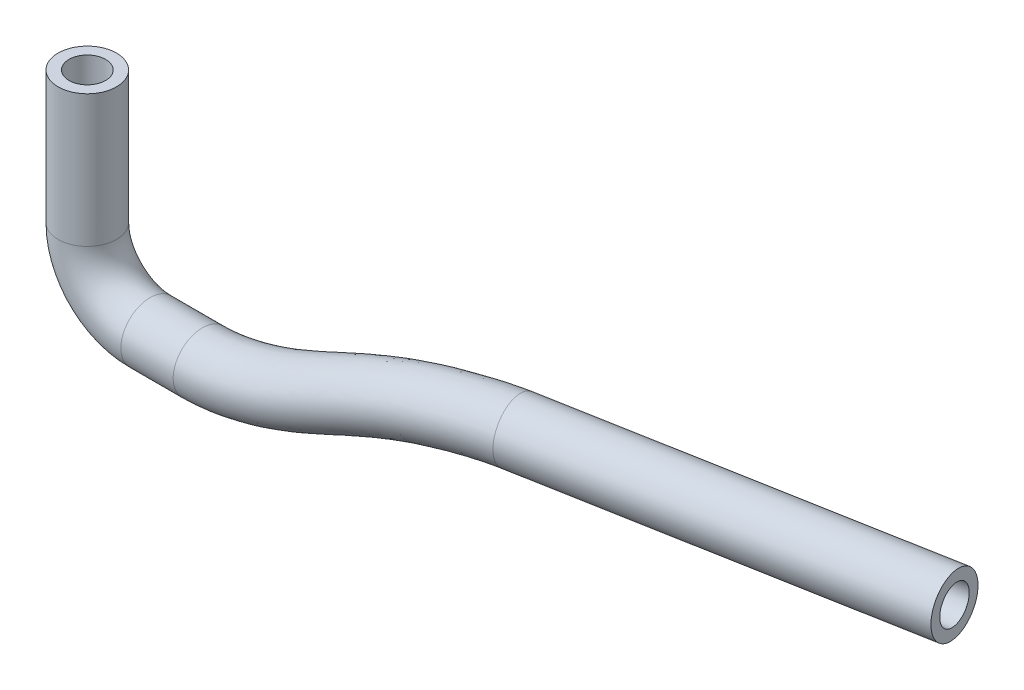
ISO-10303-21;
HEADER;
FILE_DESCRIPTION(('STEP AP214'),'2;1');
FILE_NAME('part.step','',(''),(''),'','','');
FILE_SCHEMA(('AUTOMOTIVE_DESIGN { 1 0 10303 214 1 1 1 1 }'));
ENDSEC;
DATA;
#1=APPLICATION_CONTEXT('core data for automotive mechanical design processes');
#2=APPLICATION_PROTOCOL_DEFINITION('international standard','automotive_design',2000,#1);
#3=PRODUCT_CONTEXT('',#1,'mechanical');
#4=PRODUCT('Part','Part','',(#3));
#5=PRODUCT_RELATED_PRODUCT_CATEGORY('part','',(#4));
#6=PRODUCT_DEFINITION_FORMATION('','',#4);
#7=PRODUCT_DEFINITION_CONTEXT('part definition',#1,'design');
#8=PRODUCT_DEFINITION('design','',#6,#7);
#9=PRODUCT_DEFINITION_SHAPE('','',#8);
#10=(LENGTH_UNIT() NAMED_UNIT(*) SI_UNIT(.MILLI.,.METRE.));
#11=(NAMED_UNIT(*) PLANE_ANGLE_UNIT() SI_UNIT($,.RADIAN.));
#12=(NAMED_UNIT(*) SI_UNIT($,.STERADIAN.) SOLID_ANGLE_UNIT());
#13=UNCERTAINTY_MEASURE_WITH_UNIT(LENGTH_MEASURE(1.E-05),#10,'distance_accuracy_value','');
#14=(GEOMETRIC_REPRESENTATION_CONTEXT(3) GLOBAL_UNCERTAINTY_ASSIGNED_CONTEXT((#13)) GLOBAL_UNIT_ASSIGNED_CONTEXT((#10,
#11,#12)) REPRESENTATION_CONTEXT('',''));
#15=CARTESIAN_POINT('',(0.,0.,0.));
#16=DIRECTION('',(0.,0.,1.));
#17=DIRECTION('',(1.,0.,0.));
#18=AXIS2_PLACEMENT_3D('',#15,#16,#17);
#19=CARTESIAN_POINT('',(-9.99999999999996,5.99999999999991,0.));
#20=DIRECTION('',(0.,1.,0.));
#21=DIRECTION('',(0.,0.,1.));
#22=AXIS2_PLACEMENT_3D('',#19,#20,#21);
#23=CYLINDRICAL_SURFACE('',#22,2.794);
#24=CARTESIAN_POINT('',(-9.99999999999996,5.99999999999991,0.));
#25=DIRECTION('',(0.,-1.,0.));
#26=DIRECTION('',(0.,0.,-1.));
#27=AXIS2_PLACEMENT_3D('',#24,#25,#26);
#28=CIRCLE('',#27,2.794);
#29=CARTESIAN_POINT('',(-12.794,5.99999999999991,0.));
#30=VERTEX_POINT('',#29);
#31=EDGE_CURVE('E82',#30,#30,#28,.T.);
#32=ORIENTED_EDGE('',*,*,#31,.F.);
#33=EDGE_LOOP('',(#32));
#34=FACE_BOUND('',#33,.T.);
#35=CARTESIAN_POINT('',(-9.99999999999996,18.633249580711,0.));
#36=DIRECTION('',(0.,-1.,0.));
#37=DIRECTION('',(0.,0.,-1.));
#38=AXIS2_PLACEMENT_3D('',#35,#36,#37);
#39=CIRCLE('',#38,2.794);
#40=CARTESIAN_POINT('',(-9.99999999999996,18.633249580711,-2.794));
#41=VERTEX_POINT('',#40);
#42=EDGE_CURVE('E11',#41,#41,#39,.T.);
#43=ORIENTED_EDGE('',*,*,#42,.T.);
#44=EDGE_LOOP('',(#43));
#45=FACE_BOUND('',#44,.T.);
#46=ADVANCED_FACE('F72',(#34,#45),#23,.T.);
#47=CARTESIAN_POINT('',(-9.99999999999996,5.99999999999991,0.));
#48=DIRECTION('',(0.,1.,0.));
#49=DIRECTION('',(0.,0.,1.));
#50=AXIS2_PLACEMENT_3D('',#47,#48,#49);
#51=CYLINDRICAL_SURFACE('',#50,1.75);
#52=CARTESIAN_POINT('',(-9.99999999999996,5.99999999999991,0.));
#53=DIRECTION('',(0.,-1.,0.));
#54=DIRECTION('',(0.,0.,-1.));
#55=AXIS2_PLACEMENT_3D('',#52,#53,#54);
#56=CIRCLE('',#55,1.75);
#57=CARTESIAN_POINT('',(-11.75,5.99999999999991,0.));
#58=VERTEX_POINT('',#57);
#59=EDGE_CURVE('E86',#58,#58,#56,.T.);
#60=ORIENTED_EDGE('',*,*,#59,.T.);
#61=EDGE_LOOP('',(#60));
#62=FACE_BOUND('',#61,.T.);
#63=CARTESIAN_POINT('',(-9.99999999999996,18.633249580711,0.));
#64=DIRECTION('',(0.,-1.,0.));
#65=DIRECTION('',(0.,0.,-1.));
#66=AXIS2_PLACEMENT_3D('',#63,#64,#65);
#67=CIRCLE('',#66,1.75);
#68=CARTESIAN_POINT('',(-9.99999999999996,18.633249580711,-1.75));
#69=VERTEX_POINT('',#68);
#70=EDGE_CURVE('E78',#69,#69,#67,.T.);
#71=ORIENTED_EDGE('',*,*,#70,.F.);
#72=EDGE_LOOP('',(#71));
#73=FACE_BOUND('',#72,.T.);
#74=ADVANCED_FACE('F148',(#62,#73),#51,.F.);
#75=CARTESIAN_POINT('',(-4.,5.99999999999991,0.));
#76=DIRECTION('',(0.,0.,-1.));
#77=DIRECTION('',(-1.,0.,0.));
#78=AXIS2_PLACEMENT_3D('',#75,#76,#77);
#79=TOROIDAL_SURFACE('',#78,5.99999999999996,2.794);
#80=CARTESIAN_POINT('',(-4.,0.,0.));
#81=DIRECTION('',(1.,0.,0.));
#82=DIRECTION('',(0.,0.,-1.));
#83=AXIS2_PLACEMENT_3D('',#80,#81,#82);
#84=CIRCLE('',#83,2.794);
#85=CARTESIAN_POINT('',(-4.,-2.79400000000005,0.));
#86=VERTEX_POINT('',#85);
#87=EDGE_CURVE('E91',#86,#86,#84,.T.);
#88=CARTESIAN_POINT('',(-4.,5.99999999999991,0.));
#89=DIRECTION('',(0.,0.,-1.));
#90=DIRECTION('',(-1.,0.,0.));
#91=AXIS2_PLACEMENT_3D('',#88,#89,#90);
#92=CIRCLE('',#91,8.79399999999996);
#93=EDGE_CURVE('',#86,#30,#92,.T.);
#94=ORIENTED_EDGE('',*,*,#87,.F.);
#95=ORIENTED_EDGE('',*,*,#31,.T.);
#96=ORIENTED_EDGE('',*,*,#93,.T.);
#97=ORIENTED_EDGE('',*,*,#93,.F.);
#98=EDGE_LOOP('',(#94,#96,#95,#97));
#99=FACE_BOUND('',#98,.T.);
#100=ADVANCED_FACE('F153',(#99),#79,.T.);
#101=CARTESIAN_POINT('',(-4.,5.99999999999991,0.));
#102=DIRECTION('',(0.,0.,-1.));
#103=DIRECTION('',(-1.,0.,0.));
#104=AXIS2_PLACEMENT_3D('',#101,#102,#103);
#105=TOROIDAL_SURFACE('',#104,5.99999999999996,1.75);
#106=CARTESIAN_POINT('',(-4.,0.,0.));
#107=DIRECTION('',(1.,0.,0.));
#108=DIRECTION('',(0.,0.,-1.));
#109=AXIS2_PLACEMENT_3D('',#106,#107,#108);
#110=CIRCLE('',#109,1.75);
#111=CARTESIAN_POINT('',(-4.,-1.75000000000005,0.));
#112=VERTEX_POINT('',#111);
#113=EDGE_CURVE('E94',#112,#112,#110,.T.);
#114=CARTESIAN_POINT('',(-4.,5.99999999999991,0.));
#115=DIRECTION('',(0.,0.,-1.));
#116=DIRECTION('',(-1.,0.,0.));
#117=AXIS2_PLACEMENT_3D('',#114,#115,#116);
#118=CIRCLE('',#117,7.74999999999996);
#119=EDGE_CURVE('',#112,#58,#118,.T.);
#120=ORIENTED_EDGE('',*,*,#113,.T.);
#121=ORIENTED_EDGE('',*,*,#59,.F.);
#122=ORIENTED_EDGE('',*,*,#119,.T.);
#123=ORIENTED_EDGE('',*,*,#119,.F.);
#124=EDGE_LOOP('',(#120,#122,#121,#123));
#125=FACE_BOUND('',#124,.T.);
#126=ADVANCED_FACE('F158',(#125),#105,.F.);
#127=CARTESIAN_POINT('',(-4.,0.,0.));
#128=DIRECTION('',(1.,0.,0.));
#129=DIRECTION('',(0.,1.,0.));
#130=AXIS2_PLACEMENT_3D('',#127,#128,#129);
#131=CYLINDRICAL_SURFACE('',#130,1.75);
#132=ORIENTED_EDGE('',*,*,#113,.F.);
#133=EDGE_LOOP('',(#132));
#134=FACE_BOUND('',#133,.T.);
#135=CARTESIAN_POINT('',(1.,0.,0.));
#136=DIRECTION('',(1.,0.,0.));
#137=DIRECTION('',(0.,0.,-1.));
#138=AXIS2_PLACEMENT_3D('',#135,#136,#137);
#139=CIRCLE('',#138,1.75);
#140=CARTESIAN_POINT('',(1.,0.,-1.75));
#141=VERTEX_POINT('',#140);
#142=EDGE_CURVE('E106',#141,#141,#139,.T.);
#143=ORIENTED_EDGE('',*,*,#142,.T.);
#144=EDGE_LOOP('',(#143));
#145=FACE_BOUND('',#144,.T.);
#146=ADVANCED_FACE('F116',(#134,#145),#131,.F.);
#147=CARTESIAN_POINT('',(-4.,0.,0.));
#148=DIRECTION('',(1.,0.,0.));
#149=DIRECTION('',(0.,1.,0.));
#150=AXIS2_PLACEMENT_3D('',#147,#148,#149);
#151=CYLINDRICAL_SURFACE('',#150,2.794);
#152=ORIENTED_EDGE('',*,*,#87,.T.);
#153=EDGE_LOOP('',(#152));
#154=FACE_BOUND('',#153,.T.);
#155=CARTESIAN_POINT('',(1.,0.,0.));
#156=DIRECTION('',(1.,0.,0.));
#157=DIRECTION('',(0.,0.,-1.));
#158=AXIS2_PLACEMENT_3D('',#155,#156,#157);
#159=CIRCLE('',#158,2.794);
#160=CARTESIAN_POINT('',(1.,0.,-2.794));
#161=VERTEX_POINT('',#160);
#162=EDGE_CURVE('E103',#161,#161,#159,.T.);
#163=ORIENTED_EDGE('',*,*,#162,.F.);
#164=EDGE_LOOP('',(#163));
#165=FACE_BOUND('',#164,.T.);
#166=ADVANCED_FACE('F145',(#154,#165),#151,.T.);
#167=CARTESIAN_POINT('',(-9.99999999999996,18.633249580711,0.));
#168=DIRECTION('',(0.,-1.,0.));
#169=DIRECTION('',(0.,0.,-1.));
#170=AXIS2_PLACEMENT_3D('',#167,#168,#169);
#171=PLANE('',#170);
#172=ORIENTED_EDGE('',*,*,#70,.T.);
#173=EDGE_LOOP('',(#172));
#174=FACE_BOUND('',#173,.T.);
#175=ORIENTED_EDGE('',*,*,#42,.F.);
#176=EDGE_LOOP('',(#175));
#177=FACE_BOUND('',#176,.T.);
#178=ADVANCED_FACE('F139',(#174,#177),#171,.F.);
#179=CARTESIAN_POINT('',(26.7763274249309,5.12073712071101,-4.2330318283105));
#180=DIRECTION('',(0.983846005927079,0.,-0.179016861276625));
#181=DIRECTION('',(-0.179016861276625,0.,-0.983846005927079));
#182=AXIS2_PLACEMENT_3D('',#179,#180,#181);
#183=CYLINDRICAL_SURFACE('',#182,2.794);
#184=CARTESIAN_POINT('',(26.7763274249309,5.12073712071101,-4.2330318283105));
#185=DIRECTION('',(0.983846005927079,0.,-0.179016861276626));
#186=DIRECTION('',(-0.178884406640045,-0.0384610611933434,-0.983118057932475));
#187=AXIS2_PLACEMENT_3D('',#184,#185,#186);
#188=CIRCLE('',#187,2.794);
#189=CARTESIAN_POINT('',(26.276154314524,5.12073712071101,-6.98189756887075));
#190=VERTEX_POINT('',#189);
#191=EDGE_CURVE('E107',#190,#190,#188,.T.);
#192=CARTESIAN_POINT('',(62.1947836383058,5.12073712071101,-10.677638834269));
#193=DIRECTION('',(0.983846005927079,0.,-0.179016861276626));
#194=DIRECTION('',(-0.178884406640045,-0.0384610611933434,-0.983118057932475));
#195=AXIS2_PLACEMENT_3D('',#192,#193,#194);
#196=CIRCLE('',#195,2.794);
#197=CARTESIAN_POINT('',(61.6946105278989,5.12073712071101,-13.4265045748293));
#198=VERTEX_POINT('',#197);
#199=EDGE_CURVE('E97',#198,#198,#196,.T.);
#200=CARTESIAN_POINT('',(26.276154314524,5.12073712071101,-6.98189756887075));
#201=CARTESIAN_POINT('',(26.6450965667467,5.12073712071101,-7.04902889184949));
#202=CARTESIAN_POINT('',(27.0140388189693,5.12073712071101,-7.11616021482822));
#203=CARTESIAN_POINT('',(27.7519233234147,5.12073712071101,-7.25042286078569));
#204=CARTESIAN_POINT('',(28.1208655756373,5.12073712071101,-7.31755418376443));
#205=CARTESIAN_POINT('',(28.8587500800826,5.12073712071101,-7.4518168297219));
#206=CARTESIAN_POINT('',(29.2276923323053,5.12073712071101,-7.51894815270063));
#207=CARTESIAN_POINT('',(29.9655768367506,5.12073712071101,-7.6532107986581));
#208=CARTESIAN_POINT('',(30.3345190889732,5.12073712071101,-7.72034212163683));
#209=CARTESIAN_POINT('',(31.0724035934186,5.12073712071101,-7.8546047675943));
#210=CARTESIAN_POINT('',(31.4413458456412,5.12073712071101,-7.92173609057304));
#211=CARTESIAN_POINT('',(32.1792303500865,5.12073712071101,-8.05599873653051));
#212=CARTESIAN_POINT('',(32.5481726023092,5.12073712071101,-8.12313005950924));
#213=CARTESIAN_POINT('',(33.2860571067545,5.12073712071101,-8.25739270546671));
#214=CARTESIAN_POINT('',(33.6549993589771,5.12073712071101,-8.32452402844545));
#215=CARTESIAN_POINT('',(34.3928838634224,5.12073712071101,-8.45878667440291));
#216=CARTESIAN_POINT('',(34.7618261156451,5.12073712071101,-8.52591799738165));
#217=CARTESIAN_POINT('',(35.4997106200904,5.12073712071101,-8.66018064333912));
#218=CARTESIAN_POINT('',(35.8686528723131,5.12073712071101,-8.72731196631785));
#219=CARTESIAN_POINT('',(36.6065373767584,5.12073712071101,-8.86157461227532));
#220=CARTESIAN_POINT('',(36.975479628981,5.12073712071101,-8.92870593525406));
#221=CARTESIAN_POINT('',(37.7133641334263,5.12073712071101,-9.06296858121152));
#222=CARTESIAN_POINT('',(38.082306385649,5.12073712071101,-9.13009990419026));
#223=CARTESIAN_POINT('',(38.8201908900943,5.12073712071101,-9.26436255014773));
#224=CARTESIAN_POINT('',(39.1891331423169,5.12073712071101,-9.33149387312646));
#225=CARTESIAN_POINT('',(39.9270176467623,5.12073712071101,-9.46575651908393));
#226=CARTESIAN_POINT('',(40.2959598989849,5.12073712071101,-9.53288784206267));
#227=CARTESIAN_POINT('',(41.0338444034302,5.12073712071101,-9.66715048802013));
#228=CARTESIAN_POINT('',(41.4027866556529,5.12073712071101,-9.73428181099887));
#229=CARTESIAN_POINT('',(42.1406711600982,5.12073712071101,-9.86854445695634));
#230=CARTESIAN_POINT('',(42.5096134123208,5.12073712071101,-9.93567577993507));
#231=CARTESIAN_POINT('',(43.2474979167661,5.12073712071101,-10.0699384258925));
#232=CARTESIAN_POINT('',(43.6164401689888,5.12073712071101,-10.1370697488713));
#233=CARTESIAN_POINT('',(44.3543246734341,5.12073712071101,-10.2713323948287));
#234=CARTESIAN_POINT('',(44.7232669256568,5.12073712071101,-10.3384637178075));
#235=CARTESIAN_POINT('',(45.4611514301021,5.12073712071101,-10.4727263637649));
#236=CARTESIAN_POINT('',(45.8300936823247,5.12073712071101,-10.5398576867437));
#237=CARTESIAN_POINT('',(46.56797818677,5.12073712071101,-10.6741203327012));
#238=CARTESIAN_POINT('',(46.9369204389927,5.12073712071101,-10.7412516556799));
#239=CARTESIAN_POINT('',(47.674804943438,5.12073712071101,-10.8755143016374));
#240=CARTESIAN_POINT('',(48.0437471956607,5.12073712071101,-10.9426456246161));
#241=CARTESIAN_POINT('',(48.781631700106,5.12073712071101,-11.0769082705736));
#242=CARTESIAN_POINT('',(49.1505739523286,5.12073712071101,-11.1440395935523));
#243=CARTESIAN_POINT('',(49.8884584567739,5.12073712071101,-11.2783022395098));
#244=CARTESIAN_POINT('',(50.2574007089966,5.12073712071101,-11.3454335624885));
#245=CARTESIAN_POINT('',(50.9952852134419,5.12073712071101,-11.479696208446));
#246=CARTESIAN_POINT('',(51.3642274656645,5.12073712071101,-11.5468275314247));
#247=CARTESIAN_POINT('',(52.1021119701099,5.12073712071101,-11.6810901773822));
#248=CARTESIAN_POINT('',(52.4710542223325,5.12073712071101,-11.7482215003609));
#249=CARTESIAN_POINT('',(53.2089387267778,5.12073712071101,-11.8824841463184));
#250=CARTESIAN_POINT('',(53.5778809790005,5.12073712071101,-11.9496154692971));
#251=CARTESIAN_POINT('',(54.3157654834458,5.12073712071101,-12.0838781152546));
#252=CARTESIAN_POINT('',(54.6847077356684,5.12073712071101,-12.1510094382333));
#253=CARTESIAN_POINT('',(55.4225922401138,5.12073712071101,-12.2852720841908));
#254=CARTESIAN_POINT('',(55.7915344923364,5.12073712071101,-12.3524034071695));
#255=CARTESIAN_POINT('',(56.5294189967817,5.12073712071101,-12.486666053127));
#256=CARTESIAN_POINT('',(56.8983612490044,5.12073712071101,-12.5537973761057));
#257=CARTESIAN_POINT('',(57.6362457534497,5.12073712071101,-12.6880600220632));
#258=CARTESIAN_POINT('',(58.0051880056723,5.12073712071101,-12.7551913450419));
#259=CARTESIAN_POINT('',(58.7430725101176,5.12073712071101,-12.8894539909994));
#260=CARTESIAN_POINT('',(59.1120147623403,5.12073712071101,-12.9565853139781));
#261=CARTESIAN_POINT('',(59.8498992667856,5.12073712071101,-13.0908479599356));
#262=CARTESIAN_POINT('',(60.2188415190083,5.12073712071101,-13.1579792829143));
#263=CARTESIAN_POINT('',(60.9567260234536,5.12073712071101,-13.2922419288718));
#264=CARTESIAN_POINT('',(61.3256682756762,5.12073712071101,-13.3593732518505));
#265=CARTESIAN_POINT('',(61.6946105278989,5.12073712071101,-13.4265045748293));
#266=B_SPLINE_CURVE_WITH_KNOTS('',3,(#200,#201,#202,#203,#204,#205,#206,#207,#208,#209,#210,
#211,#212,#213,#214,#215,#216,#217,#218,#219,#220,#221,#222,#223,#224,#225,#226,#227,#228,#229,
#230,#231,#232,#233,#234,#235,#236,#237,#238,#239,#240,#241,#242,#243,#244,#245,#246,#247,#248,
#249,#250,#251,#252,#253,#254,#255,#256,#257,#258,#259,#260,#261,#262,#263,#264,#265),
.UNSPECIFIED.,.F.,.F.,(4,2,2,2,2,2,2,2,2,2,2,2,2,2,2,2,2,2,2,2,2,2,2,2,2,2,2,2,2,2,2,2,4),(0.,
1.125,2.25,3.375,4.5,5.62500000000001,6.75,7.875,9.,10.125,11.25,12.375,13.5,14.625,15.75,
16.875,18.,19.125,20.25,21.375,22.5,23.625,24.75,25.875,27.,28.125,29.25,30.375,31.5,32.625,
33.75,34.875,36.),.UNSPECIFIED.);
#267=EDGE_CURVE('BSEAM129',#190,#198,#266,.T.);
#268=ORIENTED_EDGE('',*,*,#191,.T.);
#269=ORIENTED_EDGE('',*,*,#199,.F.);
#270=ORIENTED_EDGE('',*,*,#267,.T.);
#271=ORIENTED_EDGE('',*,*,#267,.F.);
#272=EDGE_LOOP('',(#268,#270,#269,#271));
#273=FACE_BOUND('',#272,.T.);
#274=ADVANCED_FACE('F129',(#273),#183,.T.);
#275=CARTESIAN_POINT('',(26.7763274249309,5.12073712071101,-4.2330318283105));
#276=DIRECTION('',(0.983846005927079,0.,-0.179016861276625));
#277=DIRECTION('',(-0.179016861276625,0.,-0.983846005927079));
#278=AXIS2_PLACEMENT_3D('',#275,#276,#277);
#279=CYLINDRICAL_SURFACE('',#278,1.75);
#280=CARTESIAN_POINT('',(26.7763274249309,5.12073712071101,-4.2330318283105));
#281=DIRECTION('',(0.983846005927079,0.,-0.179016861276626));
#282=DIRECTION('',(-0.178884406640045,-0.0384610611933434,-0.983118057932475));
#283=AXIS2_PLACEMENT_3D('',#280,#281,#282);
#284=CIRCLE('',#283,1.75);
#285=CARTESIAN_POINT('',(26.4630479176968,5.12073712071101,-5.95476233868288));
#286=VERTEX_POINT('',#285);
#287=EDGE_CURVE('E110',#286,#286,#284,.T.);
#288=CARTESIAN_POINT('',(62.1947836383058,5.12073712071101,-10.677638834269));
#289=DIRECTION('',(0.983846005927079,0.,-0.179016861276626));
#290=DIRECTION('',(-0.178884406640045,-0.0384610611933434,-0.983118057932475));
#291=AXIS2_PLACEMENT_3D('',#288,#289,#290);
#292=CIRCLE('',#291,1.75);
#293=CARTESIAN_POINT('',(61.8815041310717,5.12073712071101,-12.3993693446414));
#294=VERTEX_POINT('',#293);
#295=EDGE_CURVE('E100',#294,#294,#292,.T.);
#296=CARTESIAN_POINT('',(26.4630479176968,5.12073712071101,-5.95476233868288));
#297=CARTESIAN_POINT('',(26.8319901699195,5.12073712071101,-6.02189366166162));
#298=CARTESIAN_POINT('',(27.2009324221421,5.12073712071101,-6.08902498464035));
#299=CARTESIAN_POINT('',(27.9388169265875,5.12073712071101,-6.22328763059782));
#300=CARTESIAN_POINT('',(28.3077591788101,5.12073712071101,-6.29041895357656));
#301=CARTESIAN_POINT('',(29.0456436832554,5.12073712071101,-6.42468159953403));
#302=CARTESIAN_POINT('',(29.4145859354781,5.12073712071101,-6.49181292251276));
#303=CARTESIAN_POINT('',(30.1524704399234,5.12073712071101,-6.62607556847023));
#304=CARTESIAN_POINT('',(30.521412692146,5.12073712071101,-6.69320689144896));
#305=CARTESIAN_POINT('',(31.2592971965913,5.12073712071101,-6.82746953740643));
#306=CARTESIAN_POINT('',(31.628239448814,5.12073712071101,-6.89460086038517));
#307=CARTESIAN_POINT('',(32.3661239532593,5.12073712071101,-7.02886350634264));
#308=CARTESIAN_POINT('',(32.735066205482,5.12073712071101,-7.09599482932137));
#309=CARTESIAN_POINT('',(33.4729507099273,5.12073712071101,-7.23025747527884));
#310=CARTESIAN_POINT('',(33.8418929621499,5.12073712071101,-7.29738879825757));
#311=CARTESIAN_POINT('',(34.5797774665952,5.12073712071101,-7.43165144421504));
#312=CARTESIAN_POINT('',(34.9487197188179,5.12073712071101,-7.49878276719378));
#313=CARTESIAN_POINT('',(35.6866042232632,5.12073712071101,-7.63304541315125));
#314=CARTESIAN_POINT('',(36.0555464754859,5.12073712071101,-7.70017673612998));
#315=CARTESIAN_POINT('',(36.7934309799312,5.12073712071101,-7.83443938208745));
#316=CARTESIAN_POINT('',(37.1623732321538,5.12073712071101,-7.90157070506619));
#317=CARTESIAN_POINT('',(37.9002577365991,5.12073712071101,-8.03583335102365));
#318=CARTESIAN_POINT('',(38.2691999888218,5.12073712071101,-8.10296467400239));
#319=CARTESIAN_POINT('',(39.0070844932671,5.12073712071101,-8.23722731995986));
#320=CARTESIAN_POINT('',(39.3760267454897,5.12073712071101,-8.30435864293859));
#321=CARTESIAN_POINT('',(40.1139112499351,5.12073712071101,-8.43862128889606));
#322=CARTESIAN_POINT('',(40.4828535021577,5.12073712071101,-8.50575261187479));
#323=CARTESIAN_POINT('',(41.220738006603,5.12073712071101,-8.64001525783226));
#324=CARTESIAN_POINT('',(41.5896802588257,5.12073712071101,-8.707146580811));
#325=CARTESIAN_POINT('',(42.327564763271,5.12073712071101,-8.84140922676847));
#326=CARTESIAN_POINT('',(42.6965070154936,5.12073712071101,-8.9085405497472));
#327=CARTESIAN_POINT('',(43.4343915199389,5.12073712071101,-9.04280319570467));
#328=CARTESIAN_POINT('',(43.8033337721616,5.12073712071101,-9.1099345186834));
#329=CARTESIAN_POINT('',(44.5412182766069,5.12073712071101,-9.24419716464087));
#330=CARTESIAN_POINT('',(44.9101605288296,5.12073712071101,-9.31132848761961));
#331=CARTESIAN_POINT('',(45.6480450332749,5.12073712071101,-9.44559113357708));
#332=CARTESIAN_POINT('',(46.0169872854975,5.12073712071101,-9.51272245655581));
#333=CARTESIAN_POINT('',(46.7548717899428,5.12073712071101,-9.64698510251328));
#334=CARTESIAN_POINT('',(47.1238140421655,5.12073712071101,-9.71411642549202));
#335=CARTESIAN_POINT('',(47.8616985466108,5.12073712071101,-9.84837907144948));
#336=CARTESIAN_POINT('',(48.2306407988334,5.12073712071101,-9.91551039442822));
#337=CARTESIAN_POINT('',(48.9685253032788,5.12073712071101,-10.0497730403857));
#338=CARTESIAN_POINT('',(49.3374675555014,5.12073712071101,-10.1169043633644));
#339=CARTESIAN_POINT('',(50.0753520599467,5.12073712071101,-10.2511670093219));
#340=CARTESIAN_POINT('',(50.4442943121694,5.12073712071101,-10.3182983323006));
#341=CARTESIAN_POINT('',(51.1821788166147,5.12073712071101,-10.4525609782581));
#342=CARTESIAN_POINT('',(51.5511210688373,5.12073712071101,-10.5196923012368));
#343=CARTESIAN_POINT('',(52.2890055732827,5.12073712071101,-10.6539549471943));
#344=CARTESIAN_POINT('',(52.6579478255053,5.12073712071101,-10.721086270173));
#345=CARTESIAN_POINT('',(53.3958323299506,5.12073712071101,-10.8553489161305));
#346=CARTESIAN_POINT('',(53.7647745821733,5.12073712071101,-10.9224802391092));
#347=CARTESIAN_POINT('',(54.5026590866186,5.12073712071101,-11.0567428850667));
#348=CARTESIAN_POINT('',(54.8716013388412,5.12073712071101,-11.1238742080454));
#349=CARTESIAN_POINT('',(55.6094858432865,5.12073712071101,-11.2581368540029));
#350=CARTESIAN_POINT('',(55.9784280955092,5.12073712071101,-11.3252681769816));
#351=CARTESIAN_POINT('',(56.7163125999545,5.12073712071101,-11.4595308229391));
#352=CARTESIAN_POINT('',(57.0852548521772,5.12073712071101,-11.5266621459178));
#353=CARTESIAN_POINT('',(57.8231393566225,5.12073712071101,-11.6609247918753));
#354=CARTESIAN_POINT('',(58.1920816088451,5.12073712071101,-11.7280561148541));
#355=CARTESIAN_POINT('',(58.9299661132904,5.12073712071101,-11.8623187608115));
#356=CARTESIAN_POINT('',(59.2989083655131,5.12073712071101,-11.9294500837903));
#357=CARTESIAN_POINT('',(60.0367928699584,5.12073712071101,-12.0637127297477));
#358=CARTESIAN_POINT('',(60.405735122181,5.12073712071101,-12.1308440527265));
#359=CARTESIAN_POINT('',(61.1436196266264,5.12073712071101,-12.2651066986839));
#360=CARTESIAN_POINT('',(61.512561878849,5.12073712071101,-12.3322380216627));
#361=CARTESIAN_POINT('',(61.8815041310717,5.12073712071101,-12.3993693446414));
#362=B_SPLINE_CURVE_WITH_KNOTS('',3,(#296,#297,#298,#299,#300,#301,#302,#303,#304,#305,#306,
#307,#308,#309,#310,#311,#312,#313,#314,#315,#316,#317,#318,#319,#320,#321,#322,#323,#324,#325,
#326,#327,#328,#329,#330,#331,#332,#333,#334,#335,#336,#337,#338,#339,#340,#341,#342,#343,#344,
#345,#346,#347,#348,#349,#350,#351,#352,#353,#354,#355,#356,#357,#358,#359,#360,#361),
.UNSPECIFIED.,.F.,.F.,(4,2,2,2,2,2,2,2,2,2,2,2,2,2,2,2,2,2,2,2,2,2,2,2,2,2,2,2,2,2,2,2,4),(0.,
1.125,2.25,3.375,4.5,5.625,6.75,7.875,9.,10.125,11.25,12.375,13.5,14.625,15.75,16.875,18.,
19.125,20.25,21.375,22.5,23.625,24.75,25.875,27.,28.125,29.25,30.375,31.5,32.625,33.75,34.875,
36.),.UNSPECIFIED.);
#363=EDGE_CURVE('BSEAM125',#286,#294,#362,.T.);
#364=ORIENTED_EDGE('',*,*,#287,.F.);
#365=ORIENTED_EDGE('',*,*,#295,.T.);
#366=ORIENTED_EDGE('',*,*,#363,.T.);
#367=ORIENTED_EDGE('',*,*,#363,.F.);
#368=EDGE_LOOP('',(#364,#366,#365,#367));
#369=FACE_BOUND('',#368,.T.);
#370=ADVANCED_FACE('F125',(#369),#279,.F.);
#371=CARTESIAN_POINT('',(62.1947836383058,5.12073712071101,-10.677638834269));
#372=DIRECTION('',(0.983846005927079,0.,-0.179016861276626));
#373=DIRECTION('',(-0.178884406640045,-0.0384610611933434,-0.983118057932475));
#374=AXIS2_PLACEMENT_3D('',#371,#372,#373);
#375=PLANE('',#374);
#376=ORIENTED_EDGE('',*,*,#295,.F.);
#377=EDGE_LOOP('',(#376));
#378=FACE_BOUND('',#377,.T.);
#379=ORIENTED_EDGE('',*,*,#199,.T.);
#380=EDGE_LOOP('',(#379));
#381=FACE_BOUND('',#380,.T.);
#382=ADVANCED_FACE('F128',(#378,#381),#375,.T.);
#383=CARTESIAN_POINT('',(1.,0.,-2.794));
#384=CARTESIAN_POINT('',(2.45242638893125,0.,-2.794));
#385=CARTESIAN_POINT('',(4.47829412683504,0.184509990624356,-2.95963354263632));
#386=CARTESIAN_POINT('',(7.44259086310332,0.835342628348954,-3.33121752094148));
#387=CARTESIAN_POINT('',(10.3415713920453,1.73572907261925,-3.72203475998524));
#388=CARTESIAN_POINT('',(13.217021397721,2.87482115893757,-4.19233025893689));
#389=CARTESIAN_POINT('',(16.252042952688,3.81763925745162,-4.78932744282344));
#390=CARTESIAN_POINT('',(18.2997734750302,4.28011784992101,-5.22961452558651));
#391=CARTESIAN_POINT('',(20.5075383727175,4.64722484511862,-5.72697760620807));
#392=CARTESIAN_POINT('',(23.292363394275,4.93682125014629,-6.37102576094614));
#393=CARTESIAN_POINT('',(25.4536048358662,5.01327691573681,-6.83012838287483));
#394=CARTESIAN_POINT('',(26.2765243927786,5.01327691573681,-6.97986368217383));
#395=CARTESIAN_POINT('',(1.,-5.588,-2.794));
#396=CARTESIAN_POINT('',(2.75112827719399,-5.588,-2.794));
#397=CARTESIAN_POINT('',(5.2698001252277,-5.37120169273403,-2.98757295980652));
#398=CARTESIAN_POINT('',(8.90074161686685,-4.5572786743677,-3.43965825265531));
#399=CARTESIAN_POINT('',(12.2892548500664,-3.50848928506704,-3.90133065524951));
#400=CARTESIAN_POINT('',(15.1260247578077,-2.37561572383172,-4.37416654018234));
#401=CARTESIAN_POINT('',(17.7144941724287,-1.58339444103261,-4.88528392109016));
#402=CARTESIAN_POINT('',(19.36856785865,-1.20467254244592,-5.24056001441875));
#403=CARTESIAN_POINT('',(21.2146456837969,-0.901006342810575,-5.65745163621653));
#404=CARTESIAN_POINT('',(23.7464624235885,-0.635170818923281,-6.24197619830789));
#405=CARTESIAN_POINT('',(25.591893566129,-0.570588521161504,-6.63684163437842));
#406=CARTESIAN_POINT('',(26.3149987699919,-0.570588521161505,-6.76841509525388));
#407=CARTESIAN_POINT('',(1.,-5.588,2.794));
#408=CARTESIAN_POINT('',(2.75112827719399,-5.588,2.794));
#409=CARTESIAN_POINT('',(5.88791527963858,-5.32364702370372,2.56985637124172));
#410=CARTESIAN_POINT('',(9.66251825710079,-4.48176779320107,2.10297411623955));
#411=CARTESIAN_POINT('',(13.042681338884,-3.40765761782799,1.63068186273072));
#412=CARTESIAN_POINT('',(16.063411897394,-2.22278999665881,1.13468526998279));
#413=CARTESIAN_POINT('',(18.7906790269542,-1.38611404105788,0.594965647858545));
#414=CARTESIAN_POINT('',(20.5254368432043,-0.988846872459804,0.221848602611254));
#415=CARTESIAN_POINT('',(22.4407500703774,-0.674412933998736,-0.210147450193929));
#416=CARTESIAN_POINT('',(25.0258164455103,-0.41169030155155,-0.804662741294017));
#417=CARTESIAN_POINT('',(26.5914996304336,-0.355668111213101,-1.14317792665175));
#418=CARTESIAN_POINT('',(27.3146048342965,-0.355668111213102,-1.27475138752722));
#419=CARTESIAN_POINT('',(1.,0.,2.794));
#420=CARTESIAN_POINT('',(2.60177733306262,0.,2.794));
#421=CARTESIAN_POINT('',(5.08023741653627,0.232064659654661,2.59778570318275));
#422=CARTESIAN_POINT('',(8.17943269237925,0.910853509515585,2.21143177891565));
#423=CARTESIAN_POINT('',(11.1095549961993,1.83656073985831,1.80998674300121));
#424=CARTESIAN_POINT('',(14.1523793870602,3.02764688611048,1.31637842940283));
#425=CARTESIAN_POINT('',(17.3270698775143,4.01491965742634,0.691170250620018));
#426=CARTESIAN_POINT('',(19.459350200237,4.49594351990713,0.232336138097973));
#427=CARTESIAN_POINT('',(21.7339533986229,4.87381825393046,-0.279751285443332));
#428=CARTESIAN_POINT('',(24.5486026311186,5.16030176751802,-0.929498266102752));
#429=CARTESIAN_POINT('',(26.5031180766955,5.22819732568521,-1.34554559435993));
#430=CARTESIAN_POINT('',(27.2761304570832,5.22819732568521,-1.48619997444716));
#431=CARTESIAN_POINT('',(1.,5.588,2.794));
#432=CARTESIAN_POINT('',(2.45242638893125,5.588,2.794));
#433=CARTESIAN_POINT('',(4.27255955343396,5.78777634301305,2.62571503512377));
#434=CARTESIAN_POINT('',(6.69634712765773,6.30347481223225,2.31988944159175));
#435=CARTESIAN_POINT('',(9.17642865351457,7.0807790975446,1.9892916232717));
#436=CARTESIAN_POINT('',(12.2413468767264,8.27808376887977,1.49807158882286));
#437=CARTESIAN_POINT('',(15.8634607280744,9.41595335591056,0.787374853381491));
#438=CARTESIAN_POINT('',(18.3932635572698,9.98073391227405,0.242823673584692));
#439=CARTESIAN_POINT('',(21.0271567268684,10.4220494418596,-0.349355120692734));
#440=CARTESIAN_POINT('',(24.071388816727,10.7322938365876,-1.05433379091149));
#441=CARTESIAN_POINT('',(26.4147365229575,10.8120627625835,-1.54791326206811));
#442=CARTESIAN_POINT('',(27.23765607987,10.8120627625835,-1.69764856136711));
#443=CARTESIAN_POINT('',(1.,5.588,-2.794));
#444=CARTESIAN_POINT('',(2.15372450066851,5.588,-2.794));
#445=CARTESIAN_POINT('',(3.68678812844239,5.74022167398274,-2.93169412546614));
#446=CARTESIAN_POINT('',(5.9844401093398,6.22796393106562,-3.22277678922764));
#447=CARTESIAN_POINT('',(8.39388793402414,6.97994743030555,-3.54273886472096));
#448=CARTESIAN_POINT('',(11.3080180376342,8.12525804170686,-4.01049397769145));
#449=CARTESIAN_POINT('',(14.7895917329474,9.21867295593585,-4.69337096455672));
#450=CARTESIAN_POINT('',(17.2309790914104,9.76490824228794,-5.21866903675427));
#451=CARTESIAN_POINT('',(19.8004310616382,10.1954560330478,-5.79650357619961));
#452=CARTESIAN_POINT('',(22.8382643649616,10.5088133192159,-6.50007532358439));
#453=CARTESIAN_POINT('',(25.3153161056034,10.5971423526351,-7.02341513137123));
#454=CARTESIAN_POINT('',(26.2380500155654,10.5971423526351,-7.19131226909378));
#455=CARTESIAN_POINT('',(1.,0.,-2.794));
#456=CARTESIAN_POINT('',(2.45242638893125,0.,-2.794));
#457=CARTESIAN_POINT('',(4.47829412683504,0.184509990624356,-2.95963354263632));
#458=CARTESIAN_POINT('',(7.44259086310332,0.835342628348954,-3.33121752094148));
#459=CARTESIAN_POINT('',(10.3415713920453,1.73572907261925,-3.72203475998524));
#460=CARTESIAN_POINT('',(13.217021397721,2.87482115893757,-4.19233025893689));
#461=CARTESIAN_POINT('',(16.252042952688,3.81763925745162,-4.78932744282344));
#462=CARTESIAN_POINT('',(18.2997734750302,4.28011784992101,-5.22961452558651));
#463=CARTESIAN_POINT('',(20.5075383727175,4.64722484511862,-5.72697760620807));
#464=CARTESIAN_POINT('',(23.292363394275,4.93682125014629,-6.37102576094614));
#465=CARTESIAN_POINT('',(25.4536048358662,5.01327691573681,-6.83012838287483));
#466=CARTESIAN_POINT('',(26.2765243927786,5.01327691573681,-6.97986368217383));
#467=(BOUNDED_SURFACE() B_SPLINE_SURFACE(3,3,((#383,#384,#385,#386,#387,#388,#389,#390,#391,
#392,#393,#394),(#395,#396,#397,#398,#399,#400,#401,#402,#403,#404,#405,#406),(#407,#408,#409,
#410,#411,#412,#413,#414,#415,#416,#417,#418),(#419,#420,#421,#422,#423,#424,#425,#426,#427,
#428,#429,#430),(#431,#432,#433,#434,#435,#436,#437,#438,#439,#440,#441,#442),(#443,#444,#445,
#446,#447,#448,#449,#450,#451,#452,#453,#454),(#455,#456,#457,#458,#459,#460,#461,#462,#463,
#464,#465,#466)),.UNSPECIFIED.,.T.,.F.,.F.) B_SPLINE_SURFACE_WITH_KNOTS((4,3,4),(4,1,1,1,1,1,1,
1,1,4),(0.,0.5,1.),(0.,0.186666666666667,0.282568845338226,0.373333333333333,0.56,0.67,
0.734858981049485,0.78,0.89,1.),
.UNSPECIFIED.) GEOMETRIC_REPRESENTATION_ITEM() RATIONAL_B_SPLINE_SURFACE(((1.,1.,1.,1.,1.,1.,1.,
1.,1.,1.,1.,1.),(0.333333333333333,0.333333333333333,0.333333333333333,0.333333333333333,
0.333333333333333,0.333333333333333,0.333333333333333,0.333333333333333,0.333333333333333,
0.333333333333333,0.333333333333333,0.333333333333333),(0.333333333333333,0.333333333333333,
0.333333333333333,0.333333333333333,0.333333333333333,0.333333333333333,0.333333333333333,
0.333333333333333,0.333333333333333,0.333333333333333,0.333333333333333,0.333333333333333),(1.,
1.,1.,1.,1.,1.,1.,1.,1.,1.,1.,1.),(0.333333333333333,0.333333333333333,0.333333333333333,
0.333333333333333,0.333333333333333,0.333333333333333,0.333333333333333,0.333333333333333,
0.333333333333333,0.333333333333333,0.333333333333333,0.333333333333333),(0.333333333333333,
0.333333333333333,0.333333333333333,0.333333333333333,0.333333333333333,0.333333333333333,
0.333333333333333,0.333333333333333,0.333333333333333,0.333333333333333,0.333333333333333,
0.333333333333333),(1.,1.,1.,1.,1.,1.,1.,1.,1.,1.,1.,1.))) REPRESENTATION_ITEM('') SURFACE());
#468=ORIENTED_EDGE('',*,*,#162,.T.);
#469=EDGE_LOOP('',(#468));
#470=FACE_BOUND('',#469,.T.);
#471=ORIENTED_EDGE('',*,*,#191,.F.);
#472=EDGE_LOOP('',(#471));
#473=FACE_BOUND('',#472,.T.);
#474=ADVANCED_FACE('F121',(#470,#473),#467,.F.);
#475=CARTESIAN_POINT('',(1.,0.,-1.75));
#476=CARTESIAN_POINT('',(2.45242619917952,0.,-1.75));
#477=CARTESIAN_POINT('',(4.5937759336532,0.193394578038035,-1.92134502767598));
#478=CARTESIAN_POINT('',(7.58491280093867,0.84945024465854,-2.29569350641875));
#479=CARTESIAN_POINT('',(10.4823332300101,1.75456734402182,-2.68849484073227));
#480=CARTESIAN_POINT('',(13.3921524275995,2.90337342435785,-3.1631174297339));
#481=CARTESIAN_POINT('',(16.4531054051773,3.85449694134095,-3.7654583393205));
#482=CARTESIAN_POINT('',(18.515910057438,4.32044032656122,-4.20907862804608));
#483=CARTESIAN_POINT('',(20.7366101302513,4.68955904676492,-4.70926365307912));
#484=CARTESIAN_POINT('',(23.531383716749,4.97857387364953,-5.35517836370579));
#485=CARTESIAN_POINT('',(25.6403601705063,5.05343026362266,-5.80375313296034));
#486=CARTESIAN_POINT('',(26.4632797133109,5.05343026362266,-5.95348842969233));
#487=CARTESIAN_POINT('',(1.,-3.5,-1.75));
#488=CARTESIAN_POINT('',(2.6395158090166,-3.5,-1.75));
#489=CARTESIAN_POINT('',(5.0895295092013,-3.28638188791657,-1.93884466262528));
#490=CARTESIAN_POINT('',(8.49821409234856,-2.52817583972019,-2.36361450874458));
#491=CARTESIAN_POINT('',(11.7022494998501,-1.53010771895277,-2.80079541936936));
#492=CARTESIAN_POINT('',(14.5878417185651,-0.385196563060282,-3.27700915922093));
#493=CARTESIAN_POINT('',(17.3691002636482,0.471601818811465,-3.82555992734994));
#494=CARTESIAN_POINT('',(19.185341042243,0.885084855322092,-4.21593424919122));
#495=CARTESIAN_POINT('',(21.1795012520692,1.21446793048859,-4.6657166067365));
#496=CARTESIAN_POINT('',(23.8158050840184,1.48860031571404,-5.27434918159077));
#497=CARTESIAN_POINT('',(25.7269762336687,1.55601991481377,-5.68268949322844));
#498=CARTESIAN_POINT('',(26.4873778379076,1.55601991481377,-5.82104926465657));
#499=CARTESIAN_POINT('',(1.,-3.5,1.75));
#500=CARTESIAN_POINT('',(2.6395158090166,-3.5,1.75));
#501=CARTESIAN_POINT('',(5.47668109124104,-3.25659639371363,1.54200763849656));
#502=CARTESIAN_POINT('',(8.97534691998256,-2.48088019117273,1.10796983111441));
#503=CARTESIAN_POINT('',(12.1741522755948,-1.46695259451886,0.664137260110023));
#504=CARTESIAN_POINT('',(15.1749668059939,-0.289475366727932,0.173416992457302));
#505=CARTESIAN_POINT('',(18.0431602119014,0.595166851007516,-0.393048565266826));
#506=CARTESIAN_POINT('',(19.9099368629195,1.02026557202778,-0.794597427500982));
#507=CARTESIAN_POINT('',(21.9474621241221,1.35639293600781,-1.25384032701583));
#508=CARTESIAN_POINT('',(24.6171184477847,1.6285755860793,-1.86873051667513));
#509=CARTESIAN_POINT('',(26.3530716569089,1.69063362899047,-2.24177629046478));
#510=CARTESIAN_POINT('',(27.1134732611477,1.69063362899047,-2.38013606189291));
#511=CARTESIAN_POINT('',(1.,0.,1.75));
#512=CARTESIAN_POINT('',(2.54597100409806,0.,1.75));
#513=CARTESIAN_POINT('',(4.97079839371915,0.223180072240982,1.55950095664153));
#514=CARTESIAN_POINT('',(8.04642790322551,0.896745893206,1.17590143801589));
#515=CARTESIAN_POINT('',(10.9633537419884,1.81772246845573,0.776443466435411));
#516=CARTESIAN_POINT('',(13.9780065724623,2.9990946206902,0.287219078709512));
#517=CARTESIAN_POINT('',(17.1264400932434,3.978061973537,-0.332791566402716));
#518=CARTESIAN_POINT('',(19.242201850286,4.45562104326691,-0.788028641848404));
#519=CARTESIAN_POINT('',(21.5047655688052,4.83148405228415,-1.29743614365308));
#520=CARTESIAN_POINT('',(24.3182193158551,5.11854914401479,-1.94692026918819));
#521=CARTESIAN_POINT('',(26.2977145630293,5.18804397779936,-2.36852769284861));
#522=CARTESIAN_POINT('',(27.089375136551,5.18804397779936,-2.51257522692867));
#523=CARTESIAN_POINT('',(1.,3.5,1.75));
#524=CARTESIAN_POINT('',(2.45242619917952,3.5,1.75));
#525=CARTESIAN_POINT('',(4.46491569619726,3.70295653819559,1.5769942747865));
#526=CARTESIAN_POINT('',(7.11750888646846,4.27437197758473,1.24383304491738));
#527=CARTESIAN_POINT('',(9.75255520838203,5.10239753143033,0.888749672760799));
#528=CARTESIAN_POINT('',(12.7810463389307,6.28766460810833,0.401021164961722));
#529=CARTESIAN_POINT('',(16.2097199745854,7.3609570960665,-0.272534567538606));
#530=CARTESIAN_POINT('',(18.5744668376525,7.89097651450604,-0.781459856195827));
#531=CARTESIAN_POINT('',(21.0620690134883,8.30657516856049,-1.34103196029034));
#532=CARTESIAN_POINT('',(24.0193201839254,8.60852270195028,-2.02511002170126));
#533=CARTESIAN_POINT('',(26.2423574691497,8.68545432660826,-2.49527909523244));
#534=CARTESIAN_POINT('',(27.0652770119543,8.68545432660826,-2.64501439196443));
#535=CARTESIAN_POINT('',(1.,3.5,-1.75));
#536=CARTESIAN_POINT('',(2.26533658934243,3.5,-1.75));
#537=CARTESIAN_POINT('',(4.09802235810511,3.67317104399265,-1.90384539272668));
#538=CARTESIAN_POINT('',(6.67161150952878,4.22707632903727,-2.22777250409293));
#539=CARTESIAN_POINT('',(9.26241696017003,5.03924240699642,-2.57619426209519));
#540=CARTESIAN_POINT('',(12.1964631366338,6.19194341177598,-3.04922570024688));
#541=CARTESIAN_POINT('',(15.5371105467065,7.23739206387044,-3.70535675129107));
#542=CARTESIAN_POINT('',(17.846479072633,7.75579579780035,-4.20222300690094));
#543=CARTESIAN_POINT('',(20.2937190084335,8.16465016304126,-4.75281069942173));
#544=CARTESIAN_POINT('',(23.2469623494796,8.46854743158502,-5.4360075458208));
#545=CARTESIAN_POINT('',(25.5537441073439,8.55084061243155,-5.92481677269225));
#546=CARTESIAN_POINT('',(26.4391815887141,8.55084061243155,-6.08592759472809));
#547=CARTESIAN_POINT('',(1.,0.,-1.75));
#548=CARTESIAN_POINT('',(2.45242619917952,0.,-1.75));
#549=CARTESIAN_POINT('',(4.5937759336532,0.193394578038035,-1.92134502767598));
#550=CARTESIAN_POINT('',(7.58491280093867,0.84945024465854,-2.29569350641875));
#551=CARTESIAN_POINT('',(10.4823332300101,1.75456734402182,-2.68849484073227));
#552=CARTESIAN_POINT('',(13.3921524275995,2.90337342435785,-3.1631174297339));
#553=CARTESIAN_POINT('',(16.4531054051773,3.85449694134095,-3.7654583393205));
#554=CARTESIAN_POINT('',(18.515910057438,4.32044032656122,-4.20907862804608));
#555=CARTESIAN_POINT('',(20.7366101302513,4.68955904676492,-4.70926365307912));
#556=CARTESIAN_POINT('',(23.531383716749,4.97857387364953,-5.35517836370579));
#557=CARTESIAN_POINT('',(25.6403601705063,5.05343026362266,-5.80375313296034));
#558=CARTESIAN_POINT('',(26.4632797133109,5.05343026362266,-5.95348842969233));
#559=(BOUNDED_SURFACE() B_SPLINE_SURFACE(3,3,((#475,#476,#477,#478,#479,#480,#481,#482,#483,
#484,#485,#486),(#487,#488,#489,#490,#491,#492,#493,#494,#495,#496,#497,#498),(#499,#500,#501,
#502,#503,#504,#505,#506,#507,#508,#509,#510),(#511,#512,#513,#514,#515,#516,#517,#518,#519,
#520,#521,#522),(#523,#524,#525,#526,#527,#528,#529,#530,#531,#532,#533,#534),(#535,#536,#537,
#538,#539,#540,#541,#542,#543,#544,#545,#546),(#547,#548,#549,#550,#551,#552,#553,#554,#555,
#556,#557,#558)),.UNSPECIFIED.,.T.,.F.,.F.) B_SPLINE_SURFACE_WITH_KNOTS((4,3,4),(4,1,1,1,1,1,1,
1,1,4),(0.,0.5,1.),(0.,0.186666666666667,0.282568845338226,0.373333333333333,0.56,0.67,
0.734858981049485,0.78,0.89,1.),
.UNSPECIFIED.) GEOMETRIC_REPRESENTATION_ITEM() RATIONAL_B_SPLINE_SURFACE(((1.,1.,1.,1.,1.,1.,1.,
1.,1.,1.,1.,1.),(0.333333333333333,0.333333333333333,0.333333333333333,0.333333333333333,
0.333333333333333,0.333333333333333,0.333333333333333,0.333333333333333,0.333333333333333,
0.333333333333333,0.333333333333333,0.333333333333333),(0.333333333333333,0.333333333333333,
0.333333333333333,0.333333333333333,0.333333333333333,0.333333333333333,0.333333333333333,
0.333333333333333,0.333333333333333,0.333333333333333,0.333333333333333,0.333333333333333),(1.,
1.,1.,1.,1.,1.,1.,1.,1.,1.,1.,1.),(0.333333333333333,0.333333333333333,0.333333333333333,
0.333333333333333,0.333333333333333,0.333333333333333,0.333333333333333,0.333333333333333,
0.333333333333333,0.333333333333333,0.333333333333333,0.333333333333333),(0.333333333333333,
0.333333333333333,0.333333333333333,0.333333333333333,0.333333333333333,0.333333333333333,
0.333333333333333,0.333333333333333,0.333333333333333,0.333333333333333,0.333333333333333,
0.333333333333333),(1.,1.,1.,1.,1.,1.,1.,1.,1.,1.,1.,1.))) REPRESENTATION_ITEM('') SURFACE());
#560=ORIENTED_EDGE('',*,*,#142,.F.);
#561=EDGE_LOOP('',(#560));
#562=FACE_BOUND('',#561,.T.);
#563=ORIENTED_EDGE('',*,*,#287,.T.);
#564=EDGE_LOOP('',(#563));
#565=FACE_BOUND('',#564,.T.);
#566=ADVANCED_FACE('F118',(#562,#565),#559,.T.);
#567=CLOSED_SHELL('',(#46,#74,#100,#126,#146,#166,#178,#274,#370,#382,#474,#566));
#568=MANIFOLD_SOLID_BREP('B2',#567);
#569=ADVANCED_BREP_SHAPE_REPRESENTATION('',(#18,#568),#14);
#570=SHAPE_DEFINITION_REPRESENTATION(#9,#569);
ENDSEC;
END-ISO-10303-21;
